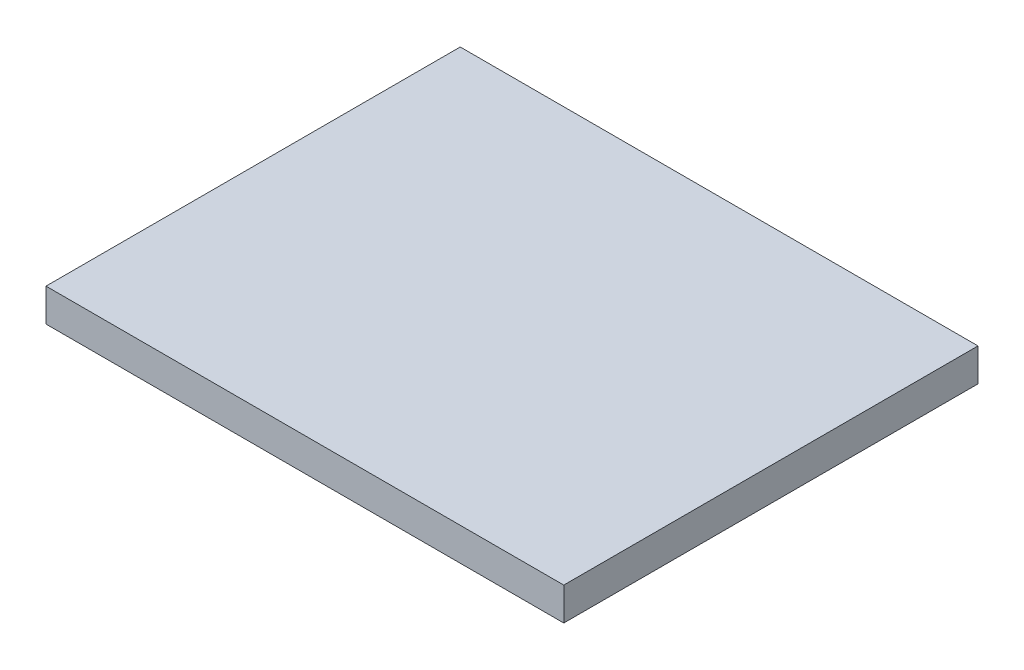
ISO-10303-21;
HEADER;
FILE_DESCRIPTION(('STEP AP214'),'2;1');
FILE_NAME('part.step','',(''),(''),'','','');
FILE_SCHEMA(('AUTOMOTIVE_DESIGN { 1 0 10303 214 1 1 1 1 }'));
ENDSEC;
DATA;
#1=APPLICATION_CONTEXT('core data for automotive mechanical design processes');
#2=APPLICATION_PROTOCOL_DEFINITION('international standard','automotive_design',2000,#1);
#3=PRODUCT_CONTEXT('',#1,'mechanical');
#4=PRODUCT('Part','Part','',(#3));
#5=PRODUCT_RELATED_PRODUCT_CATEGORY('part','',(#4));
#6=PRODUCT_DEFINITION_FORMATION('','',#4);
#7=PRODUCT_DEFINITION_CONTEXT('part definition',#1,'design');
#8=PRODUCT_DEFINITION('design','',#6,#7);
#9=PRODUCT_DEFINITION_SHAPE('','',#8);
#10=(LENGTH_UNIT() NAMED_UNIT(*) SI_UNIT(.MILLI.,.METRE.));
#11=(NAMED_UNIT(*) PLANE_ANGLE_UNIT() SI_UNIT($,.RADIAN.));
#12=(NAMED_UNIT(*) SI_UNIT($,.STERADIAN.) SOLID_ANGLE_UNIT());
#13=UNCERTAINTY_MEASURE_WITH_UNIT(LENGTH_MEASURE(1.E-05),#10,'distance_accuracy_value','');
#14=(GEOMETRIC_REPRESENTATION_CONTEXT(3) GLOBAL_UNCERTAINTY_ASSIGNED_CONTEXT((#13)) GLOBAL_UNIT_ASSIGNED_CONTEXT((#10,
#11,#12)) REPRESENTATION_CONTEXT('',''));
#15=CARTESIAN_POINT('',(0.,0.,0.));
#16=DIRECTION('',(0.,0.,1.));
#17=DIRECTION('',(1.,0.,0.));
#18=AXIS2_PLACEMENT_3D('',#15,#16,#17);
#19=CARTESIAN_POINT('',(0.,6.35,0.));
#20=DIRECTION('',(1.,0.,0.));
#21=DIRECTION('',(0.,0.,-1.));
#22=AXIS2_PLACEMENT_3D('',#19,#20,#21);
#23=PLANE('',#22);
#24=DIRECTION('',(0.,0.,1.));
#25=VECTOR('',#24,1.);
#26=CARTESIAN_POINT('',(0.,0.,0.));
#27=LINE('',#26,#25);
#28=CARTESIAN_POINT('',(0.,0.,-80.));
#29=VERTEX_POINT('',#28);
#30=CARTESIAN_POINT('',(0.,0.,0.));
#31=VERTEX_POINT('',#30);
#32=EDGE_CURVE('E96',#29,#31,#27,.T.);
#33=ORIENTED_EDGE('',*,*,#32,.T.);
#34=DIRECTION('',(0.,-1.,0.));
#35=VECTOR('',#34,1.);
#36=CARTESIAN_POINT('',(0.,6.35,0.));
#37=LINE('',#36,#35);
#38=CARTESIAN_POINT('',(0.,6.35,0.));
#39=VERTEX_POINT('',#38);
#40=EDGE_CURVE('E11',#39,#31,#37,.T.);
#41=ORIENTED_EDGE('',*,*,#40,.F.);
#42=DIRECTION('',(0.,0.,1.));
#43=VECTOR('',#42,1.);
#44=CARTESIAN_POINT('',(0.,6.35,0.));
#45=LINE('',#44,#43);
#46=CARTESIAN_POINT('',(0.,6.35,-80.));
#47=VERTEX_POINT('',#46);
#48=EDGE_CURVE('E84',#47,#39,#45,.T.);
#49=ORIENTED_EDGE('',*,*,#48,.F.);
#50=DIRECTION('',(0.,-1.,0.));
#51=VECTOR('',#50,1.);
#52=CARTESIAN_POINT('',(0.,6.35,-80.));
#53=LINE('',#52,#51);
#54=EDGE_CURVE('E92',#47,#29,#53,.T.);
#55=ORIENTED_EDGE('',*,*,#54,.T.);
#56=EDGE_LOOP('',(#33,#41,#49,#55));
#57=FACE_BOUND('',#56,.T.);
#58=ADVANCED_FACE('F33',(#57),#23,.F.);
#59=CARTESIAN_POINT('',(0.,6.35,0.));
#60=DIRECTION('',(0.,0.,-1.));
#61=DIRECTION('',(-1.,0.,0.));
#62=AXIS2_PLACEMENT_3D('',#59,#60,#61);
#63=PLANE('',#62);
#64=DIRECTION('',(1.,0.,0.));
#65=VECTOR('',#64,1.);
#66=CARTESIAN_POINT('',(0.,0.,0.));
#67=LINE('',#66,#65);
#68=CARTESIAN_POINT('',(100.,0.,0.));
#69=VERTEX_POINT('',#68);
#70=EDGE_CURVE('E88',#31,#69,#67,.T.);
#71=ORIENTED_EDGE('',*,*,#70,.T.);
#72=DIRECTION('',(0.,-1.,0.));
#73=VECTOR('',#72,1.);
#74=CARTESIAN_POINT('',(100.,6.35,0.));
#75=LINE('',#74,#73);
#76=CARTESIAN_POINT('',(100.,6.35,0.));
#77=VERTEX_POINT('',#76);
#78=EDGE_CURVE('E41',#77,#69,#75,.T.);
#79=ORIENTED_EDGE('',*,*,#78,.F.);
#80=DIRECTION('',(1.,0.,0.));
#81=VECTOR('',#80,1.);
#82=CARTESIAN_POINT('',(0.,6.35,0.));
#83=LINE('',#82,#81);
#84=EDGE_CURVE('E79',#39,#77,#83,.T.);
#85=ORIENTED_EDGE('',*,*,#84,.F.);
#86=ORIENTED_EDGE('',*,*,#40,.T.);
#87=EDGE_LOOP('',(#71,#79,#85,#86));
#88=FACE_BOUND('',#87,.T.);
#89=ADVANCED_FACE('F87',(#88),#63,.F.);
#90=CARTESIAN_POINT('',(100.,6.35,0.));
#91=DIRECTION('',(-1.,0.,0.));
#92=DIRECTION('',(0.,0.,1.));
#93=AXIS2_PLACEMENT_3D('',#90,#91,#92);
#94=PLANE('',#93);
#95=DIRECTION('',(0.,0.,-1.));
#96=VECTOR('',#95,1.);
#97=CARTESIAN_POINT('',(100.,0.,0.));
#98=LINE('',#97,#96);
#99=CARTESIAN_POINT('',(100.,0.,-80.));
#100=VERTEX_POINT('',#99);
#101=EDGE_CURVE('E66',#69,#100,#98,.T.);
#102=ORIENTED_EDGE('',*,*,#101,.T.);
#103=DIRECTION('',(0.,-1.,0.));
#104=VECTOR('',#103,1.);
#105=CARTESIAN_POINT('',(100.,6.35,-80.));
#106=LINE('',#105,#104);
#107=CARTESIAN_POINT('',(100.,6.35,-80.));
#108=VERTEX_POINT('',#107);
#109=EDGE_CURVE('E89',#108,#100,#106,.T.);
#110=ORIENTED_EDGE('',*,*,#109,.F.);
#111=DIRECTION('',(0.,0.,-1.));
#112=VECTOR('',#111,1.);
#113=CARTESIAN_POINT('',(100.,6.35,0.));
#114=LINE('',#113,#112);
#115=EDGE_CURVE('E82',#77,#108,#114,.T.);
#116=ORIENTED_EDGE('',*,*,#115,.F.);
#117=ORIENTED_EDGE('',*,*,#78,.T.);
#118=EDGE_LOOP('',(#102,#110,#116,#117));
#119=FACE_BOUND('',#118,.T.);
#120=ADVANCED_FACE('F90',(#119),#94,.F.);
#121=CARTESIAN_POINT('',(0.,6.35,-80.));
#122=DIRECTION('',(0.,0.,1.));
#123=DIRECTION('',(1.,0.,0.));
#124=AXIS2_PLACEMENT_3D('',#121,#122,#123);
#125=PLANE('',#124);
#126=DIRECTION('',(-1.,0.,0.));
#127=VECTOR('',#126,1.);
#128=CARTESIAN_POINT('',(0.,0.,-80.));
#129=LINE('',#128,#127);
#130=EDGE_CURVE('E72',#100,#29,#129,.T.);
#131=ORIENTED_EDGE('',*,*,#130,.T.);
#132=ORIENTED_EDGE('',*,*,#54,.F.);
#133=DIRECTION('',(-1.,0.,0.));
#134=VECTOR('',#133,1.);
#135=CARTESIAN_POINT('',(0.,6.35,-80.));
#136=LINE('',#135,#134);
#137=EDGE_CURVE('E49',#108,#47,#136,.T.);
#138=ORIENTED_EDGE('',*,*,#137,.F.);
#139=ORIENTED_EDGE('',*,*,#109,.T.);
#140=EDGE_LOOP('',(#131,#132,#138,#139));
#141=FACE_BOUND('',#140,.T.);
#142=ADVANCED_FACE('F103',(#141),#125,.F.);
#143=CARTESIAN_POINT('',(0.,6.35,0.));
#144=DIRECTION('',(0.,-1.,0.));
#145=DIRECTION('',(0.,0.,-1.));
#146=AXIS2_PLACEMENT_3D('',#143,#144,#145);
#147=PLANE('',#146);
#148=ORIENTED_EDGE('',*,*,#48,.T.);
#149=ORIENTED_EDGE('',*,*,#84,.T.);
#150=ORIENTED_EDGE('',*,*,#115,.T.);
#151=ORIENTED_EDGE('',*,*,#137,.T.);
#152=EDGE_LOOP('',(#148,#149,#150,#151));
#153=FACE_BOUND('',#152,.T.);
#154=ADVANCED_FACE('F80',(#153),#147,.F.);
#155=CARTESIAN_POINT('',(0.,0.,0.));
#156=DIRECTION('',(0.,-1.,0.));
#157=DIRECTION('',(0.,0.,-1.));
#158=AXIS2_PLACEMENT_3D('',#155,#156,#157);
#159=PLANE('',#158);
#160=ORIENTED_EDGE('',*,*,#32,.F.);
#161=ORIENTED_EDGE('',*,*,#130,.F.);
#162=ORIENTED_EDGE('',*,*,#101,.F.);
#163=ORIENTED_EDGE('',*,*,#70,.F.);
#164=EDGE_LOOP('',(#160,#161,#162,#163));
#165=FACE_BOUND('',#164,.T.);
#166=ADVANCED_FACE('F106',(#165),#159,.T.);
#167=CLOSED_SHELL('',(#58,#89,#120,#142,#154,#166));
#168=MANIFOLD_SOLID_BREP('B2',#167);
#169=ADVANCED_BREP_SHAPE_REPRESENTATION('',(#18,#168),#14);
#170=SHAPE_DEFINITION_REPRESENTATION(#9,#169);
ENDSEC;
END-ISO-10303-21;
